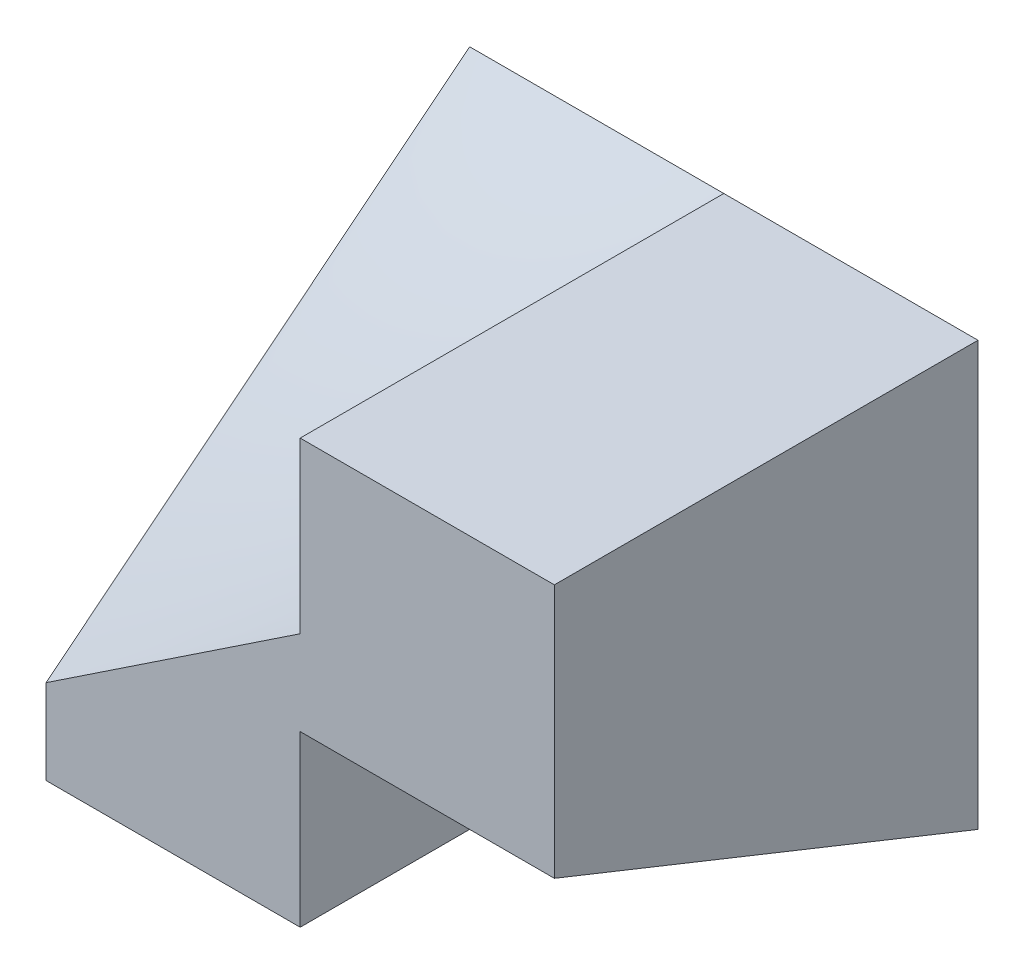
ISO-10303-21;
HEADER;
FILE_DESCRIPTION(('STEP AP214'),'2;1');
FILE_NAME('part.step','',(''),(''),'','','');
FILE_SCHEMA(('AUTOMOTIVE_DESIGN { 1 0 10303 214 1 1 1 1 }'));
ENDSEC;
DATA;
#1=APPLICATION_CONTEXT('core data for automotive mechanical design processes');
#2=APPLICATION_PROTOCOL_DEFINITION('international standard','automotive_design',2000,#1);
#3=PRODUCT_CONTEXT('',#1,'mechanical');
#4=PRODUCT('Part','Part','',(#3));
#5=PRODUCT_RELATED_PRODUCT_CATEGORY('part','',(#4));
#6=PRODUCT_DEFINITION_FORMATION('','',#4);
#7=PRODUCT_DEFINITION_CONTEXT('part definition',#1,'design');
#8=PRODUCT_DEFINITION('design','',#6,#7);
#9=PRODUCT_DEFINITION_SHAPE('','',#8);
#10=(LENGTH_UNIT() NAMED_UNIT(*) SI_UNIT(.MILLI.,.METRE.));
#11=(NAMED_UNIT(*) PLANE_ANGLE_UNIT() SI_UNIT($,.RADIAN.));
#12=(NAMED_UNIT(*) SI_UNIT($,.STERADIAN.) SOLID_ANGLE_UNIT());
#13=UNCERTAINTY_MEASURE_WITH_UNIT(LENGTH_MEASURE(1.E-05),#10,'distance_accuracy_value','');
#14=(GEOMETRIC_REPRESENTATION_CONTEXT(3) GLOBAL_UNCERTAINTY_ASSIGNED_CONTEXT((#13)) GLOBAL_UNIT_ASSIGNED_CONTEXT((#10,
#11,#12)) REPRESENTATION_CONTEXT('',''));
#15=CARTESIAN_POINT('',(0.,0.,0.));
#16=DIRECTION('',(0.,0.,1.));
#17=DIRECTION('',(1.,0.,0.));
#18=AXIS2_PLACEMENT_3D('',#15,#16,#17);
#19=CARTESIAN_POINT('',(-30.,25.,25.));
#20=DIRECTION('',(0.,-1.,0.));
#21=DIRECTION('',(0.,0.,-1.));
#22=AXIS2_PLACEMENT_3D('',#19,#20,#21);
#23=PLANE('',#22);
#24=DIRECTION('',(0.,0.,-1.));
#25=VECTOR('',#24,1.);
#26=CARTESIAN_POINT('',(-15.,25.,25.));
#27=LINE('',#26,#25);
#28=CARTESIAN_POINT('',(-15.,25.,25.));
#29=VERTEX_POINT('',#28);
#30=CARTESIAN_POINT('',(-15.0000950253126,25.0000998920424,5.99352254294661E-05));
#31=VERTEX_POINT('',#30);
#32=EDGE_CURVE('E139',#29,#31,#27,.T.);
#33=ORIENTED_EDGE('',*,*,#32,.F.);
#34=DIRECTION('',(-1.,0.,0.));
#35=VECTOR('',#34,1.);
#36=CARTESIAN_POINT('',(-30.,25.,25.));
#37=LINE('',#36,#35);
#38=CARTESIAN_POINT('',(0.,25.,25.));
#39=VERTEX_POINT('',#38);
#40=EDGE_CURVE('E209',#39,#29,#37,.T.);
#41=ORIENTED_EDGE('',*,*,#40,.F.);
#42=DIRECTION('',(0.,0.,-1.));
#43=VECTOR('',#42,1.);
#44=CARTESIAN_POINT('',(0.,25.,25.));
#45=LINE('',#44,#43);
#46=CARTESIAN_POINT('',(0.,25.,0.));
#47=VERTEX_POINT('',#46);
#48=EDGE_CURVE('E190',#39,#47,#45,.T.);
#49=ORIENTED_EDGE('',*,*,#48,.T.);
#50=DIRECTION('',(-1.,0.,0.));
#51=VECTOR('',#50,1.);
#52=CARTESIAN_POINT('',(-30.,25.,0.));
#53=LINE('',#52,#51);
#54=EDGE_CURVE('E185',#47,#31,#53,.T.);
#55=ORIENTED_EDGE('',*,*,#54,.T.);
#56=EDGE_LOOP('',(#33,#41,#49,#55));
#57=FACE_BOUND('',#56,.T.);
#58=ADVANCED_FACE('F33',(#57),#23,.F.);
#59=CARTESIAN_POINT('',(0.,0.,25.));
#60=DIRECTION('',(0.,1.,0.));
#61=DIRECTION('',(-1.,0.,0.));
#62=AXIS2_PLACEMENT_3D('',#59,#60,#61);
#63=PLANE('',#62);
#64=DIRECTION('',(0.,0.,-1.));
#65=VECTOR('',#64,1.);
#66=CARTESIAN_POINT('',(-15.,0.,0.));
#67=LINE('',#66,#65);
#68=CARTESIAN_POINT('',(-15.,0.,25.));
#69=VERTEX_POINT('',#68);
#70=CARTESIAN_POINT('',(-15.,0.,0.));
#71=VERTEX_POINT('',#70);
#72=EDGE_CURVE('E102',#69,#71,#67,.T.);
#73=ORIENTED_EDGE('',*,*,#72,.F.);
#74=DIRECTION('',(1.,0.,0.));
#75=VECTOR('',#74,1.);
#76=CARTESIAN_POINT('',(0.,0.,25.));
#77=LINE('',#76,#75);
#78=CARTESIAN_POINT('',(-30.,0.,25.));
#79=VERTEX_POINT('',#78);
#80=EDGE_CURVE('E115',#79,#69,#77,.T.);
#81=ORIENTED_EDGE('',*,*,#80,.F.);
#82=DIRECTION('',(0.,0.,-1.));
#83=VECTOR('',#82,1.);
#84=CARTESIAN_POINT('',(-30.,0.,25.));
#85=LINE('',#84,#83);
#86=CARTESIAN_POINT('',(-30.,0.,0.));
#87=VERTEX_POINT('',#86);
#88=EDGE_CURVE('E189',#79,#87,#85,.T.);
#89=ORIENTED_EDGE('',*,*,#88,.T.);
#90=DIRECTION('',(1.,0.,0.));
#91=VECTOR('',#90,1.);
#92=CARTESIAN_POINT('',(0.,0.,0.));
#93=LINE('',#92,#91);
#94=EDGE_CURVE('E117',#87,#71,#93,.T.);
#95=ORIENTED_EDGE('',*,*,#94,.T.);
#96=EDGE_LOOP('',(#73,#81,#89,#95));
#97=FACE_BOUND('',#96,.T.);
#98=ADVANCED_FACE('F113',(#97),#63,.F.);
#99=CARTESIAN_POINT('',(0.,25.,25.));
#100=DIRECTION('',(-1.,0.,0.));
#101=DIRECTION('',(0.,0.,1.));
#102=AXIS2_PLACEMENT_3D('',#99,#100,#101);
#103=PLANE('',#102);
#104=DIRECTION('',(0.,-0.371390676354104,-0.928476690885259));
#105=VECTOR('',#104,1.);
#106=CARTESIAN_POINT('',(0.,0.,0.));
#107=LINE('',#106,#105);
#108=CARTESIAN_POINT('',(0.,10.,25.));
#109=VERTEX_POINT('',#108);
#110=CARTESIAN_POINT('',(0.,0.,0.));
#111=VERTEX_POINT('',#110);
#112=EDGE_CURVE('E131',#109,#111,#107,.T.);
#113=ORIENTED_EDGE('',*,*,#112,.T.);
#114=DIRECTION('',(0.,1.,0.));
#115=VECTOR('',#114,1.);
#116=CARTESIAN_POINT('',(0.,25.,0.));
#117=LINE('',#116,#115);
#118=EDGE_CURVE('E133',#111,#47,#117,.T.);
#119=ORIENTED_EDGE('',*,*,#118,.T.);
#120=ORIENTED_EDGE('',*,*,#48,.F.);
#121=DIRECTION('',(0.,1.,0.));
#122=VECTOR('',#121,1.);
#123=CARTESIAN_POINT('',(0.,25.,25.));
#124=LINE('',#123,#122);
#125=EDGE_CURVE('E123',#109,#39,#124,.T.);
#126=ORIENTED_EDGE('',*,*,#125,.F.);
#127=EDGE_LOOP('',(#113,#119,#120,#126));
#128=FACE_BOUND('',#127,.T.);
#129=ADVANCED_FACE('F204',(#128),#103,.F.);
#130=CARTESIAN_POINT('',(0.,0.,25.));
#131=DIRECTION('',(0.,0.,-1.));
#132=DIRECTION('',(-1.,0.,0.));
#133=AXIS2_PLACEMENT_3D('',#130,#131,#132);
#134=PLANE('',#133);
#135=DIRECTION('',(0.,1.,0.));
#136=VECTOR('',#135,1.);
#137=CARTESIAN_POINT('',(-15.,15.,25.));
#138=LINE('',#137,#136);
#139=CARTESIAN_POINT('',(-14.9999395760296,14.9996374561779,24.9998912368534));
#140=VERTEX_POINT('',#139);
#141=EDGE_CURVE('E11',#140,#29,#138,.T.);
#142=ORIENTED_EDGE('',*,*,#141,.F.);
#143=CARTESIAN_POINT('',(-29.9999630920947,4.99988927794308,24.9999335665848));
#144=CARTESIAN_POINT('',(-29.3749882842003,5.41663068598087,24.9999785024925));
#145=CARTESIAN_POINT('',(-28.7500189910903,5.83338037558723,25.000029308736));
#146=CARTESIAN_POINT('',(-27.5000654158993,6.66683478897252,25.0001039416081));
#147=CARTESIAN_POINT('',(-26.8750811342396,7.08353951338328,25.0001277686848));
#148=CARTESIAN_POINT('',(-25.6250706836873,7.91684306275874,25.0001097272883));
#149=CARTESIAN_POINT('',(-25.0000445167589,8.33344189066979,25.0000678609044));
#150=CARTESIAN_POINT('',(-23.7499783651048,9.16660730959967,24.9999637805651));
#151=CARTESIAN_POINT('',(-23.1249383805416,9.58317390086205,24.9999015667823));
#152=CARTESIAN_POINT('',(-21.8748969426531,10.4164123857147,24.9998414433101));
#153=CARTESIAN_POINT('',(-21.249895491446,10.8330842824838,24.9998435358744));
#154=CARTESIAN_POINT('',(-19.9999581904191,11.6665980289791,24.9999526219996));
#155=CARTESIAN_POINT('',(-19.3750223458208,12.0834398865319,25.0000596211115));
#156=CARTESIAN_POINT('',(-18.125188284125,12.9171630946964,25.0003053212919));
#157=CARTESIAN_POINT('',(-17.5002900666523,13.3340444447437,25.0004440219604));
#158=CARTESIAN_POINT('',(-16.250296589282,14.1672161856311,25.0003668294385));
#159=CARTESIAN_POINT('',(-15.62520140198,14.5835066854385,25.0001510134996));
#160=CARTESIAN_POINT('',(-14.9997583041186,14.9992749123557,24.9995649474135));
#161=B_SPLINE_CURVE_WITH_KNOTS('',3,(#143,#144,#145,#146,#147,#148,#149,#150,#151,#152,#153,
#154,#155,#156,#157,#158,#159,#160),.UNSPECIFIED.,.F.,.F.,(4,2,2,2,2,2,2,2,4),(0.,
2.25353106880685,4.50702471180827,6.76044668983405,9.01384954522266,11.2673313758012,
13.5209324537895,15.7745051020476,18.0275867469638),.UNSPECIFIED.);
#162=CARTESIAN_POINT('',(-30.,4.99990575436026,25.));
#163=VERTEX_POINT('',#162);
#164=EDGE_CURVE('E125',#140,#163,#161,.F.);
#165=ORIENTED_EDGE('',*,*,#164,.T.);
#166=DIRECTION('',(0.,-1.,0.));
#167=VECTOR('',#166,1.);
#168=CARTESIAN_POINT('',(-30.,0.,25.));
#169=LINE('',#168,#167);
#170=EDGE_CURVE('E120',#163,#79,#169,.T.);
#171=ORIENTED_EDGE('',*,*,#170,.T.);
#172=ORIENTED_EDGE('',*,*,#80,.T.);
#173=DIRECTION('',(0.,-1.,0.));
#174=VECTOR('',#173,1.);
#175=CARTESIAN_POINT('',(-15.,0.,25.));
#176=LINE('',#175,#174);
#177=CARTESIAN_POINT('',(-15.,10.,25.));
#178=VERTEX_POINT('',#177);
#179=EDGE_CURVE('E99',#178,#69,#176,.T.);
#180=ORIENTED_EDGE('',*,*,#179,.F.);
#181=DIRECTION('',(1.,0.,0.));
#182=VECTOR('',#181,1.);
#183=CARTESIAN_POINT('',(-15.,10.,25.));
#184=LINE('',#183,#182);
#185=EDGE_CURVE('E121',#178,#109,#184,.T.);
#186=ORIENTED_EDGE('',*,*,#185,.T.);
#187=ORIENTED_EDGE('',*,*,#125,.T.);
#188=ORIENTED_EDGE('',*,*,#40,.T.);
#189=EDGE_LOOP('',(#142,#165,#171,#172,#180,#186,#187,#188));
#190=FACE_BOUND('',#189,.T.);
#191=ADVANCED_FACE('F35',(#190),#134,.F.);
#192=CARTESIAN_POINT('',(-30.,0.,25.));
#193=DIRECTION('',(1.,0.,0.));
#194=DIRECTION('',(0.,1.,0.));
#195=AXIS2_PLACEMENT_3D('',#192,#193,#194);
#196=PLANE('',#195);
#197=ORIENTED_EDGE('',*,*,#170,.F.);
#198=CARTESIAN_POINT('',(-29.9999634408011,24.9998903224033,-6.58065579852359E-05));
#199=CARTESIAN_POINT('',(-29.9999692653511,24.16657327223,1.04161283241119));
#200=CARTESIAN_POINT('',(-29.9999701074484,23.3332427330099,2.08328068007639));
#201=CARTESIAN_POINT('',(-29.999967316895,21.6665682303247,4.16660832086125));
#202=CARTESIAN_POINT('',(-29.9999636842372,20.8332242668406,5.20826811396568));
#203=CARTESIAN_POINT('',(-29.9999574343486,19.166539526437,7.29158935258851));
#204=CARTESIAN_POINT('',(-29.9999548171173,18.3331987495161,8.33325079810577));
#205=CARTESIAN_POINT('',(-29.999958964505,16.666544873778,10.4165911607804));
#206=CARTESIAN_POINT('',(-29.9999657290984,15.8332317748913,11.4582700778823));
#207=CARTESIAN_POINT('',(-29.999987425869,14.1666296640146,13.5416431335548));
#208=CARTESIAN_POINT('',(-30.0000023580268,13.3333406519722,14.5833372720835));
#209=CARTESIAN_POINT('',(-30.0000306456395,11.6667576278174,16.6667230485275));
#210=CARTESIAN_POINT('',(-30.000044001093,10.8334636157012,17.7084146864397));
#211=CARTESIAN_POINT('',(-30.0000538577641,9.1668255992997,19.7917669114659));
#212=CARTESIAN_POINT('',(-30.0000503588934,8.33348159477555,20.8334274983889));
#213=CARTESIAN_POINT('',(-30.0000229367263,6.66673231240338,22.9167119083268));
#214=CARTESIAN_POINT('',(-29.9999990132833,5.83332703415858,23.9583357310244));
#215=CARTESIAN_POINT('',(-29.9999630925471,4.9998892776414,24.9999335665848));
#216=B_SPLINE_CURVE_WITH_KNOTS('',3,(#198,#199,#200,#201,#202,#203,#204,#205,#206,#207,#208,
#209,#210,#211,#212,#213,#214,#215),.UNSPECIFIED.,.F.,.F.,(4,2,2,2,2,2,2,2,4),(0.,
4.00195017869086,8.0039066469927,12.0058610141702,16.0078044395664,20.0097383851563,
24.0116758422469,28.0136342450585,32.0156213644847),.UNSPECIFIED.);
#217=CARTESIAN_POINT('',(-29.9999907267676,24.9998922027332,-1.66918183146211E-05));
#218=VERTEX_POINT('',#217);
#219=EDGE_CURVE('E63',#163,#218,#216,.F.);
#220=ORIENTED_EDGE('',*,*,#219,.T.);
#221=DIRECTION('',(0.,-1.,0.));
#222=VECTOR('',#221,1.);
#223=CARTESIAN_POINT('',(-30.,0.,0.));
#224=LINE('',#223,#222);
#225=EDGE_CURVE('E136',#218,#87,#224,.T.);
#226=ORIENTED_EDGE('',*,*,#225,.T.);
#227=ORIENTED_EDGE('',*,*,#88,.F.);
#228=EDGE_LOOP('',(#197,#220,#226,#227));
#229=FACE_BOUND('',#228,.T.);
#230=ADVANCED_FACE('F163',(#229),#196,.F.);
#231=CARTESIAN_POINT('',(0.,0.,0.));
#232=DIRECTION('',(0.,0.,-1.));
#233=DIRECTION('',(-1.,0.,0.));
#234=AXIS2_PLACEMENT_3D('',#231,#232,#233);
#235=PLANE('',#234);
#236=ORIENTED_EDGE('',*,*,#225,.F.);
#237=CARTESIAN_POINT('',(-15.0001878555792,25.0005635667377,0.000338140042596628));
#238=CARTESIAN_POINT('',(-15.6250735514618,24.9998898710617,-6.60773629782301E-05));
#239=CARTESIAN_POINT('',(-16.2499594003065,24.999612028171,-0.000232783097383472));
#240=CARTESIAN_POINT('',(-17.4998656059674,24.9994598212944,-0.00032410722338317));
#241=CARTESIAN_POINT('',(-18.1248859628101,24.9995855440911,-0.00024867354537142));
#242=CARTESIAN_POINT('',(-19.3749471215325,24.999852202079,-8.86787526337471E-05));
#243=CARTESIAN_POINT('',(-19.9999879234103,24.9999931377691,-4.11733856414106E-06));
#244=CARTESIAN_POINT('',(-21.2500440439128,25.0001793227635,0.000107593658073718));
#245=CARTESIAN_POINT('',(-21.8750593625359,25.0002245759744,0.000134745584660191));
#246=CARTESIAN_POINT('',(-23.1250631759572,25.0002234890461,0.000134093427643131));
#247=CARTESIAN_POINT('',(-23.7500516707558,25.0001771528365,0.000106291701896912));
#248=CARTESIAN_POINT('',(-25.0000219851585,25.0000638343149,3.83005889397284E-05));
#249=CARTESIAN_POINT('',(-25.6250038047626,24.9999968522233,-1.88866600634463E-06));
#250=CARTESIAN_POINT('',(-26.8749792093195,24.9999169073742,-4.98555755270279E-05));
#251=CARTESIAN_POINT('',(-27.4999727942722,24.9999039456331,-5.76326201802075E-05));
#252=CARTESIAN_POINT('',(-28.7499654004052,24.9998943308556,-6.34014866434204E-05));
#253=CARTESIAN_POINT('',(-29.3749644215854,24.9998976779611,-6.1393223346639E-05));
#254=CARTESIAN_POINT('',(-29.9999634408011,24.9998903224033,-6.58065579837655E-05));
#255=B_SPLINE_CURVE_WITH_KNOTS('',3,(#237,#238,#239,#240,#241,#242,#243,#244,#245,#246,#247,
#248,#249,#250,#251,#252,#253,#254),.UNSPECIFIED.,.F.,.F.,(4,2,2,2,2,2,2,2,4),(0.,
1.87465783844972,3.74971882991415,5.62484133261062,7.49988727294103,9.3748527637539,
11.249798235763,13.124778989669,14.9997760510766),.UNSPECIFIED.);
#256=EDGE_CURVE('E69',#31,#218,#255,.T.);
#257=ORIENTED_EDGE('',*,*,#256,.F.);
#258=ORIENTED_EDGE('',*,*,#54,.F.);
#259=ORIENTED_EDGE('',*,*,#118,.F.);
#260=DIRECTION('',(1.,0.,0.));
#261=VECTOR('',#260,1.);
#262=CARTESIAN_POINT('',(-15.,0.,0.));
#263=LINE('',#262,#261);
#264=EDGE_CURVE('E108',#71,#111,#263,.T.);
#265=ORIENTED_EDGE('',*,*,#264,.F.);
#266=ORIENTED_EDGE('',*,*,#94,.F.);
#267=EDGE_LOOP('',(#236,#257,#258,#259,#265,#266));
#268=FACE_BOUND('',#267,.T.);
#269=ADVANCED_FACE('F166',(#268),#235,.T.);
#270=CARTESIAN_POINT('',(-15.,0.,0.));
#271=DIRECTION('',(0.,-0.928476690885259,0.371390676354104));
#272=DIRECTION('',(0.,-0.371390676354104,-0.928476690885259));
#273=AXIS2_PLACEMENT_3D('',#270,#271,#272);
#274=PLANE('',#273);
#275=ORIENTED_EDGE('',*,*,#112,.F.);
#276=ORIENTED_EDGE('',*,*,#185,.F.);
#277=DIRECTION('',(0.,-0.371390676354104,-0.928476690885259));
#278=VECTOR('',#277,1.);
#279=CARTESIAN_POINT('',(-15.,0.,0.));
#280=LINE('',#279,#278);
#281=EDGE_CURVE('E104',#178,#71,#280,.T.);
#282=ORIENTED_EDGE('',*,*,#281,.T.);
#283=ORIENTED_EDGE('',*,*,#264,.T.);
#284=EDGE_LOOP('',(#275,#276,#282,#283));
#285=FACE_BOUND('',#284,.T.);
#286=ADVANCED_FACE('F200',(#285),#274,.T.);
#287=CARTESIAN_POINT('',(-15.,0.,0.));
#288=DIRECTION('',(1.,0.,0.));
#289=DIRECTION('',(0.,0.,-1.));
#290=AXIS2_PLACEMENT_3D('',#287,#288,#289);
#291=PLANE('',#290);
#292=ORIENTED_EDGE('',*,*,#281,.F.);
#293=ORIENTED_EDGE('',*,*,#179,.T.);
#294=ORIENTED_EDGE('',*,*,#72,.T.);
#295=EDGE_LOOP('',(#292,#293,#294));
#296=FACE_BOUND('',#295,.T.);
#297=ADVANCED_FACE('F101',(#296),#291,.T.);
#298=CARTESIAN_POINT('',(-13.5578165787204,25.1140243369603,-0.300267292080254));
#299=CARTESIAN_POINT('',(-17.1202912847284,25.1261416896457,-0.29670903090629));
#300=CARTESIAN_POINT('',(-20.6905927566779,25.1617393401554,-0.279062591038036));
#301=CARTESIAN_POINT('',(-24.2523866796185,25.1718143436378,-0.276729739385594));
#302=CARTESIAN_POINT('',(-27.8191802591177,25.196888316797,-0.265397505927978));
#303=CARTESIAN_POINT('',(-31.3840469518743,25.2161816297274,-0.257533668606697));
#304=CARTESIAN_POINT('',(-13.918844785409,22.8467947138869,5.89084085325424));
#305=CARTESIAN_POINT('',(-17.338974909885,22.4318783219757,5.63817886767001));
#306=CARTESIAN_POINT('',(-20.7650423647256,22.0347739211586,5.39620407674251));
#307=CARTESIAN_POINT('',(-24.2088287480853,21.6908263058994,5.18612335714915));
#308=CARTESIAN_POINT('',(-27.6478886236285,21.3326991671897,4.96753492348634));
#309=CARTESIAN_POINT('',(-31.0928353134287,20.9922324712521,4.75954275548595));
#310=CARTESIAN_POINT('',(-14.2540330595043,20.5020452930337,12.0354371199193));
#311=CARTESIAN_POINT('',(-17.5380996462337,19.6789382878826,11.5378607663926));
#312=CARTESIAN_POINT('',(-20.843931280292,18.9211264247179,11.0794614980567));
#313=CARTESIAN_POINT('',(-24.1602891792297,18.1948933561924,10.6400095065037));
#314=CARTESIAN_POINT('',(-27.48949271287,17.5071971917747,10.2236796574154));
#315=CARTESIAN_POINT('',(-30.8278446610084,16.8469462708502,9.82381695442393));
#316=CARTESIAN_POINT('',(-14.5393769847491,18.007762825628,18.0903135586569));
#317=CARTESIAN_POINT('',(-17.7042088223915,16.8269515732162,17.3781146567709));
#318=CARTESIAN_POINT('',(-20.8885283355732,15.7046033474231,16.7009935708571));
#319=CARTESIAN_POINT('',(-24.1008997573518,14.6664108474194,16.0743659204179));
#320=CARTESIAN_POINT('',(-27.3344549317799,13.6917696053649,15.4858690247479));
#321=CARTESIAN_POINT('',(-30.5854896806821,12.7695670867344,14.9288353631317));
#322=CARTESIAN_POINT('',(-14.8323791276057,15.5364550110594,24.1589747890907));
#323=CARTESIAN_POINT('',(-17.8553936435474,13.9301917935455,23.1915047081457));
#324=CARTESIAN_POINT('',(-20.9287436052317,12.4749349132588,22.3146384295367));
#325=CARTESIAN_POINT('',(-24.0480490237329,11.1575444034237,21.5204919731982));
#326=CARTESIAN_POINT('',(-27.1860793940763,9.89632874911485,20.7600504301758));
#327=CARTESIAN_POINT('',(-30.3566090979647,8.7326110954408,20.0581076875346));
#328=CARTESIAN_POINT('',(-15.0600027760243,12.8690117131749,30.1099547295409));
#329=CARTESIAN_POINT('',(-17.986995208113,10.9746822441024,28.9696448976597));
#330=CARTESIAN_POINT('',(-20.9616350904589,9.22329512580137,27.9151004762414));
#331=CARTESIAN_POINT('',(-23.9893656964934,7.63118017856598,26.9561193574626));
#332=CARTESIAN_POINT('',(-27.04933130194,6.13577022956659,26.0551612376255));
#333=CARTESIAN_POINT('',(-30.1411023309387,4.73577655122411,25.2114528801825));
#334=B_SPLINE_SURFACE_WITH_KNOTS('',5,5,((#298,#299,#300,#301,#302,#303),(#304,#305,#306,#307,
#308,#309),(#310,#311,#312,#313,#314,#315),(#316,#317,#318,#319,#320,#321),(#322,#323,#324,#325,
#326,#327),(#328,#329,#330,#331,#332,#333)),.UNSPECIFIED.,.F.,.F.,.F.,(6,6),(6,6),
(-14.9014987710772,17.4750725096387),(-8.5684148981131,8.5412946946897),.UNSPECIFIED.);
#335=CARTESIAN_POINT('',(-14.9997583041186,14.9992749123557,24.9995649474135));
#336=CARTESIAN_POINT('',(-15.0001530367411,15.417174094096,23.9584880064519));
#337=CARTESIAN_POINT('',(-15.0002582397772,15.8341448233514,22.9170395715494));
#338=CARTESIAN_POINT('',(-15.0002246131752,16.6673541857537,20.8337034381453));
#339=CARTESIAN_POINT('',(-15.0000857539853,17.0835927241359,19.7918157017236));
#340=CARTESIAN_POINT('',(-14.9998990977819,17.9163544103867,17.7081755834046));
#341=CARTESIAN_POINT('',(-14.9998512991465,18.3328775530542,16.6664231994271));
#342=CARTESIAN_POINT('',(-14.9998504692647,19.166210981541,14.5830819103096));
#343=CARTESIAN_POINT('',(-14.9998974342041,19.5830212551283,13.5414930002775));
#344=CARTESIAN_POINT('',(-15.0000075337226,20.4166904971035,11.4583438208615));
#345=CARTESIAN_POINT('',(-15.0000706681794,20.8335494650992,10.4167835513206));
#346=CARTESIAN_POINT('',(-15.0001289718377,21.667061007134,8.33354692025541));
#347=CARTESIAN_POINT('',(-15.0001241391547,22.0837135751303,7.29187055631305));
#348=CARTESIAN_POINT('',(-15.0000350146912,22.9167725863568,5.20839417073623));
#349=CARTESIAN_POINT('',(-14.9999507212516,23.3331790242663,4.16659414697392));
#350=CARTESIAN_POINT('',(-14.9999157909478,24.1663928731076,2.08323467304583));
#351=CARTESIAN_POINT('',(-14.9999651452183,24.5832002556095,1.04167521150604));
#352=CARTESIAN_POINT('',(-15.0001878555792,25.0005635667377,0.000338140042591682));
#353=B_SPLINE_CURVE_WITH_KNOTS('',3,(#335,#336,#337,#338,#339,#340,#341,#342,#343,#344,#345,
#346,#347,#348,#349,#350,#351,#352),.UNSPECIFIED.,.F.,.F.,(4,2,2,2,2,2,2,2,4),(0.,
3.36545931154523,6.73132615086986,10.0971330442395,13.4628044686016,16.8284504362484,
20.19418971815,23.5599992775983,26.9255855724379),.UNSPECIFIED.);
#354=EDGE_CURVE('E44',#31,#140,#353,.F.);
#355=ORIENTED_EDGE('',*,*,#354,.F.);
#356=ORIENTED_EDGE('',*,*,#256,.T.);
#357=ORIENTED_EDGE('',*,*,#219,.F.);
#358=ORIENTED_EDGE('',*,*,#164,.F.);
#359=EDGE_LOOP('',(#355,#356,#357,#358));
#360=FACE_BOUND('',#359,.T.);
#361=ADVANCED_FACE('F156',(#360),#334,.F.);
#362=CARTESIAN_POINT('',(-15.,25.,0.));
#363=DIRECTION('',(-1.,0.,0.));
#364=DIRECTION('',(0.,0.,1.));
#365=AXIS2_PLACEMENT_3D('',#362,#363,#364);
#366=PLANE('',#365);
#367=ORIENTED_EDGE('',*,*,#32,.T.);
#368=ORIENTED_EDGE('',*,*,#354,.T.);
#369=ORIENTED_EDGE('',*,*,#141,.T.);
#370=EDGE_LOOP('',(#367,#368,#369));
#371=FACE_BOUND('',#370,.T.);
#372=ADVANCED_FACE('F146',(#371),#366,.T.);
#373=CLOSED_SHELL('',(#58,#98,#129,#191,#230,#269,#286,#297,#361,#372));
#374=MANIFOLD_SOLID_BREP('B2',#373);
#375=ADVANCED_BREP_SHAPE_REPRESENTATION('',(#18,#374),#14);
#376=SHAPE_DEFINITION_REPRESENTATION(#9,#375);
ENDSEC;
END-ISO-10303-21;
